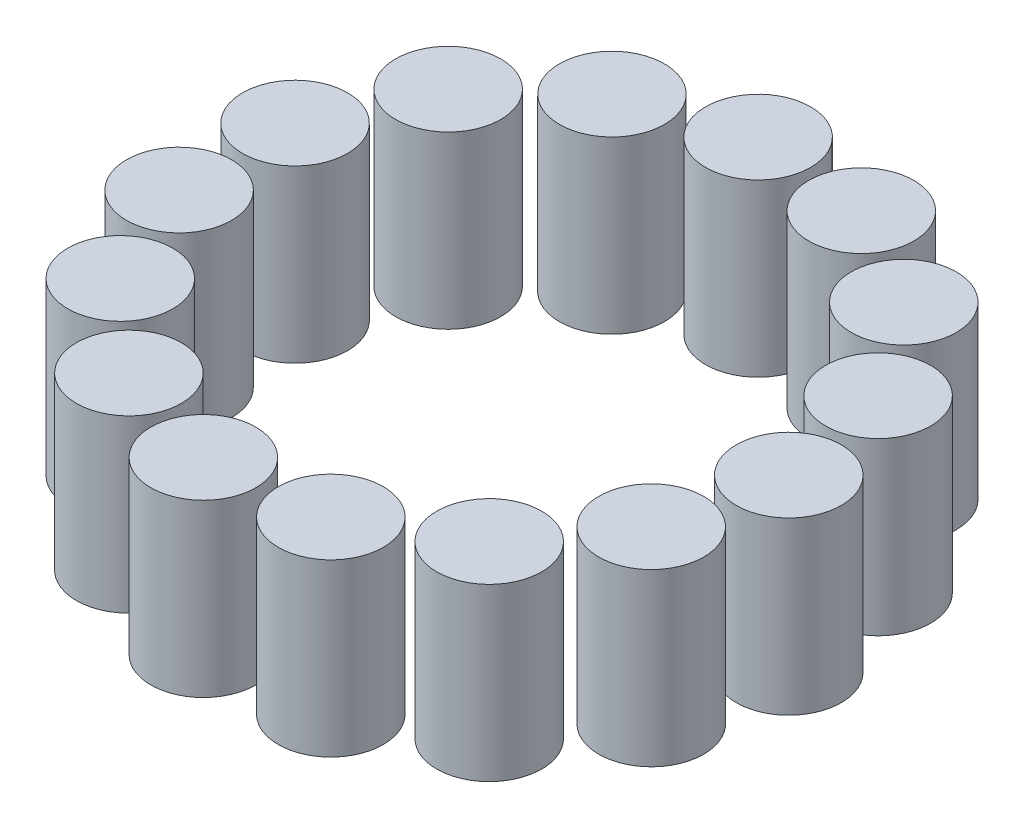
ISO-10303-21;
HEADER;
FILE_DESCRIPTION(('STEP AP214'),'2;1');
FILE_NAME('part.step','',(''),(''),'','','');
FILE_SCHEMA(('AUTOMOTIVE_DESIGN { 1 0 10303 214 1 1 1 1 }'));
ENDSEC;
DATA;
#1=APPLICATION_CONTEXT('core data for automotive mechanical design processes');
#2=APPLICATION_PROTOCOL_DEFINITION('international standard','automotive_design',2000,#1);
#3=PRODUCT_CONTEXT('',#1,'mechanical');
#4=PRODUCT('Part','Part','',(#3));
#5=PRODUCT_RELATED_PRODUCT_CATEGORY('part','',(#4));
#6=PRODUCT_DEFINITION_FORMATION('','',#4);
#7=PRODUCT_DEFINITION_CONTEXT('part definition',#1,'design');
#8=PRODUCT_DEFINITION('design','',#6,#7);
#9=PRODUCT_DEFINITION_SHAPE('','',#8);
#10=(LENGTH_UNIT() NAMED_UNIT(*) SI_UNIT(.MILLI.,.METRE.));
#11=(NAMED_UNIT(*) PLANE_ANGLE_UNIT() SI_UNIT($,.RADIAN.));
#12=(NAMED_UNIT(*) SI_UNIT($,.STERADIAN.) SOLID_ANGLE_UNIT());
#13=UNCERTAINTY_MEASURE_WITH_UNIT(LENGTH_MEASURE(1.E-05),#10,'distance_accuracy_value','');
#14=(GEOMETRIC_REPRESENTATION_CONTEXT(3) GLOBAL_UNCERTAINTY_ASSIGNED_CONTEXT((#13)) GLOBAL_UNIT_ASSIGNED_CONTEXT((#10,
#11,#12)) REPRESENTATION_CONTEXT('',''));
#15=CARTESIAN_POINT('',(0.,0.,0.));
#16=DIRECTION('',(0.,0.,1.));
#17=DIRECTION('',(1.,0.,0.));
#18=AXIS2_PLACEMENT_3D('',#15,#16,#17);
#19=CARTESIAN_POINT('',(14.9136295960155,10.,-6.63997569821225));
#20=DIRECTION('',(0.,-1.,0.));
#21=DIRECTION('',(-0.406736643075789,0.,-0.913545457642606));
#22=AXIS2_PLACEMENT_3D('',#19,#20,#21);
#23=CYLINDRICAL_SURFACE('',#22,3.075);
#24=CARTESIAN_POINT('',(14.9136295960155,10.,-6.63997569821225));
#25=DIRECTION('',(0.,1.,0.));
#26=DIRECTION('',(0.406736643075789,0.,0.913545457642606));
#27=AXIS2_PLACEMENT_3D('',#24,#25,#26);
#28=CIRCLE('',#27,3.075);
#29=CARTESIAN_POINT('',(16.1643447734736,10.,-3.83082341596124));
#30=VERTEX_POINT('',#29);
#31=EDGE_CURVE('E11',#30,#30,#28,.T.);
#32=ORIENTED_EDGE('',*,*,#31,.F.);
#33=EDGE_LOOP('',(#32));
#34=FACE_BOUND('',#33,.T.);
#35=CARTESIAN_POINT('',(14.9136295960155,0.,-6.63997569821225));
#36=DIRECTION('',(0.,1.,0.));
#37=DIRECTION('',(0.406736643075789,0.,0.913545457642606));
#38=AXIS2_PLACEMENT_3D('',#35,#36,#37);
#39=CIRCLE('',#38,3.075);
#40=CARTESIAN_POINT('',(16.1643447734736,0.,-3.83082341596124));
#41=VERTEX_POINT('',#40);
#42=EDGE_CURVE('E42',#41,#41,#39,.T.);
#43=ORIENTED_EDGE('',*,*,#42,.T.);
#44=EDGE_LOOP('',(#43));
#45=FACE_BOUND('',#44,.T.);
#46=ADVANCED_FACE('F39',(#34,#45),#23,.T.);
#47=CARTESIAN_POINT('',(14.9136295960155,10.,-6.63997569821225));
#48=DIRECTION('',(0.,1.,0.));
#49=DIRECTION('',(0.406736643075789,0.,0.913545457642606));
#50=AXIS2_PLACEMENT_3D('',#47,#48,#49);
#51=PLANE('',#50);
#52=ORIENTED_EDGE('',*,*,#31,.T.);
#53=EDGE_LOOP('',(#52));
#54=FACE_BOUND('',#53,.T.);
#55=ADVANCED_FACE('F54',(#54),#51,.T.);
#56=CARTESIAN_POINT('',(14.9136295960155,0.,-6.63997569821225));
#57=DIRECTION('',(0.,1.,0.));
#58=DIRECTION('',(0.406736643075789,0.,0.913545457642606));
#59=AXIS2_PLACEMENT_3D('',#56,#57,#58);
#60=PLANE('',#59);
#61=ORIENTED_EDGE('',*,*,#42,.F.);
#62=EDGE_LOOP('',(#61));
#63=FACE_BOUND('',#62,.T.);
#64=ADVANCED_FACE('F52',(#63),#60,.F.);
#65=CLOSED_SHELL('',(#46,#55,#64));
#66=MANIFOLD_SOLID_BREP('B2',#65);
#67=CARTESIAN_POINT('',(10.9235571488085,10.,-12.1318392759183));
#68=DIRECTION('',(0.,-1.,0.));
#69=DIRECTION('',(-0.743144825477386,0.,-0.669130606358867));
#70=AXIS2_PLACEMENT_3D('',#67,#68,#69);
#71=CYLINDRICAL_SURFACE('',#70,3.075);
#72=CARTESIAN_POINT('',(10.9235571488085,10.,-12.1318392759183));
#73=DIRECTION('',(0.,1.,0.));
#74=DIRECTION('',(0.743144825477386,0.,0.669130606358867));
#75=AXIS2_PLACEMENT_3D('',#72,#73,#74);
#76=CIRCLE('',#75,3.075);
#77=CARTESIAN_POINT('',(13.2087274871515,10.,-10.0742626613648));
#78=VERTEX_POINT('',#77);
#79=EDGE_CURVE('E38',#78,#78,#76,.T.);
#80=ORIENTED_EDGE('',*,*,#79,.F.);
#81=EDGE_LOOP('',(#80));
#82=FACE_BOUND('',#81,.T.);
#83=CARTESIAN_POINT('',(10.9235571488085,0.,-12.1318392759183));
#84=DIRECTION('',(0.,1.,0.));
#85=DIRECTION('',(0.743144825477386,0.,0.669130606358867));
#86=AXIS2_PLACEMENT_3D('',#83,#84,#85);
#87=CIRCLE('',#86,3.075);
#88=CARTESIAN_POINT('',(13.2087274871515,0.,-10.0742626613648));
#89=VERTEX_POINT('',#88);
#90=EDGE_CURVE('E90',#89,#89,#87,.T.);
#91=ORIENTED_EDGE('',*,*,#90,.T.);
#92=EDGE_LOOP('',(#91));
#93=FACE_BOUND('',#92,.T.);
#94=ADVANCED_FACE('F87',(#82,#93),#71,.T.);
#95=CARTESIAN_POINT('',(10.9235571488085,10.,-12.1318392759183));
#96=DIRECTION('',(0.,1.,0.));
#97=DIRECTION('',(0.743144825477386,0.,0.669130606358867));
#98=AXIS2_PLACEMENT_3D('',#95,#96,#97);
#99=PLANE('',#98);
#100=ORIENTED_EDGE('',*,*,#79,.T.);
#101=EDGE_LOOP('',(#100));
#102=FACE_BOUND('',#101,.T.);
#103=ADVANCED_FACE('F102',(#102),#99,.T.);
#104=CARTESIAN_POINT('',(10.9235571488085,0.,-12.1318392759183));
#105=DIRECTION('',(0.,1.,0.));
#106=DIRECTION('',(0.743144825477386,0.,0.669130606358867));
#107=AXIS2_PLACEMENT_3D('',#104,#105,#106);
#108=PLANE('',#107);
#109=ORIENTED_EDGE('',*,*,#90,.F.);
#110=EDGE_LOOP('',(#109));
#111=FACE_BOUND('',#110,.T.);
#112=ADVANCED_FACE('F100',(#111),#108,.F.);
#113=CLOSED_SHELL('',(#94,#103,#112));
#114=MANIFOLD_SOLID_BREP('B6',#113);
#115=CARTESIAN_POINT('',(5.04470243317118,10.,-15.5259976285183));
#116=DIRECTION('',(0.,-1.,0.));
#117=DIRECTION('',(-0.95105651629515,0.,-0.309016994374957));
#118=AXIS2_PLACEMENT_3D('',#115,#116,#117);
#119=CYLINDRICAL_SURFACE('',#118,3.075);
#120=CARTESIAN_POINT('',(5.04470243317118,10.,-15.5259976285183));
#121=DIRECTION('',(0.,1.,0.));
#122=DIRECTION('',(0.95105651629515,0.,0.309016994374957));
#123=AXIS2_PLACEMENT_3D('',#120,#121,#122);
#124=CIRCLE('',#123,3.075);
#125=CARTESIAN_POINT('',(7.96920122077876,10.,-14.5757703708153));
#126=VERTEX_POINT('',#125);
#127=EDGE_CURVE('E86',#126,#126,#124,.T.);
#128=ORIENTED_EDGE('',*,*,#127,.F.);
#129=EDGE_LOOP('',(#128));
#130=FACE_BOUND('',#129,.T.);
#131=CARTESIAN_POINT('',(5.04470243317118,0.,-15.5259976285183));
#132=DIRECTION('',(0.,1.,0.));
#133=DIRECTION('',(0.95105651629515,0.,0.309016994374957));
#134=AXIS2_PLACEMENT_3D('',#131,#132,#133);
#135=CIRCLE('',#134,3.075);
#136=CARTESIAN_POINT('',(7.96920122077876,0.,-14.5757703708153));
#137=VERTEX_POINT('',#136);
#138=EDGE_CURVE('E138',#137,#137,#135,.T.);
#139=ORIENTED_EDGE('',*,*,#138,.T.);
#140=EDGE_LOOP('',(#139));
#141=FACE_BOUND('',#140,.T.);
#142=ADVANCED_FACE('F135',(#130,#141),#119,.T.);
#143=CARTESIAN_POINT('',(5.04470243317118,10.,-15.5259976285183));
#144=DIRECTION('',(0.,1.,0.));
#145=DIRECTION('',(0.95105651629515,0.,0.309016994374957));
#146=AXIS2_PLACEMENT_3D('',#143,#144,#145);
#147=PLANE('',#146);
#148=ORIENTED_EDGE('',*,*,#127,.T.);
#149=EDGE_LOOP('',(#148));
#150=FACE_BOUND('',#149,.T.);
#151=ADVANCED_FACE('F150',(#150),#147,.T.);
#152=CARTESIAN_POINT('',(5.04470243317118,0.,-15.5259976285183));
#153=DIRECTION('',(0.,1.,0.));
#154=DIRECTION('',(0.95105651629515,0.,0.309016994374957));
#155=AXIS2_PLACEMENT_3D('',#152,#153,#154);
#156=PLANE('',#155);
#157=ORIENTED_EDGE('',*,*,#138,.F.);
#158=EDGE_LOOP('',(#157));
#159=FACE_BOUND('',#158,.T.);
#160=ADVANCED_FACE('F148',(#159),#156,.F.);
#161=CLOSED_SHELL('',(#142,#151,#160));
#162=MANIFOLD_SOLID_BREP('B33',#161);
#163=CARTESIAN_POINT('',(-1.70642716284428,10.,-16.2355699418871));
#164=DIRECTION('',(0.,-1.,0.));
#165=DIRECTION('',(-0.994521895368274,0.,0.104528463267644));
#166=AXIS2_PLACEMENT_3D('',#163,#164,#165);
#167=CYLINDRICAL_SURFACE('',#166,3.075);
#168=CARTESIAN_POINT('',(-1.70642716284428,10.,-16.2355699418871));
#169=DIRECTION('',(0.,1.,0.));
#170=DIRECTION('',(0.994521895368274,0.,-0.104528463267644));
#171=AXIS2_PLACEMENT_3D('',#168,#169,#170);
#172=CIRCLE('',#171,3.075);
#173=CARTESIAN_POINT('',(1.35172766541316,10.,-16.5569949664351));
#174=VERTEX_POINT('',#173);
#175=EDGE_CURVE('E134',#174,#174,#172,.T.);
#176=ORIENTED_EDGE('',*,*,#175,.F.);
#177=EDGE_LOOP('',(#176));
#178=FACE_BOUND('',#177,.T.);
#179=CARTESIAN_POINT('',(-1.70642716284428,0.,-16.2355699418871));
#180=DIRECTION('',(0.,1.,0.));
#181=DIRECTION('',(0.994521895368274,0.,-0.104528463267644));
#182=AXIS2_PLACEMENT_3D('',#179,#180,#181);
#183=CIRCLE('',#182,3.075);
#184=CARTESIAN_POINT('',(1.35172766541316,0.,-16.5569949664351));
#185=VERTEX_POINT('',#184);
#186=EDGE_CURVE('E186',#185,#185,#183,.T.);
#187=ORIENTED_EDGE('',*,*,#186,.T.);
#188=EDGE_LOOP('',(#187));
#189=FACE_BOUND('',#188,.T.);
#190=ADVANCED_FACE('F183',(#178,#189),#167,.T.);
#191=CARTESIAN_POINT('',(-1.70642716284428,10.,-16.2355699418871));
#192=DIRECTION('',(0.,1.,0.));
#193=DIRECTION('',(0.994521895368274,0.,-0.104528463267644));
#194=AXIS2_PLACEMENT_3D('',#191,#192,#193);
#195=PLANE('',#194);
#196=ORIENTED_EDGE('',*,*,#175,.T.);
#197=EDGE_LOOP('',(#196));
#198=FACE_BOUND('',#197,.T.);
#199=ADVANCED_FACE('F198',(#198),#195,.T.);
#200=CARTESIAN_POINT('',(-1.70642716284428,0.,-16.2355699418871));
#201=DIRECTION('',(0.,1.,0.));
#202=DIRECTION('',(0.994521895368274,0.,-0.104528463267644));
#203=AXIS2_PLACEMENT_3D('',#200,#201,#202);
#204=PLANE('',#203);
#205=ORIENTED_EDGE('',*,*,#186,.F.);
#206=EDGE_LOOP('',(#205));
#207=FACE_BOUND('',#206,.T.);
#208=ADVANCED_FACE('F196',(#207),#204,.F.);
#209=CLOSED_SHELL('',(#190,#199,#208));
#210=MANIFOLD_SOLID_BREP('B81',#209);
#211=CARTESIAN_POINT('',(-8.16249999999987,10.,-14.137864716781));
#212=DIRECTION('',(0.,-1.,0.));
#213=DIRECTION('',(-0.866025403784443,0.,0.499999999999992));
#214=AXIS2_PLACEMENT_3D('',#211,#212,#213);
#215=CYLINDRICAL_SURFACE('',#214,3.075);
#216=CARTESIAN_POINT('',(-8.16249999999987,10.,-14.137864716781));
#217=DIRECTION('',(0.,1.,0.));
#218=DIRECTION('',(0.866025403784443,0.,-0.499999999999992));
#219=AXIS2_PLACEMENT_3D('',#216,#217,#218);
#220=CIRCLE('',#219,3.075);
#221=CARTESIAN_POINT('',(-5.49947188336271,10.,-15.675364716781));
#222=VERTEX_POINT('',#221);
#223=EDGE_CURVE('E182',#222,#222,#220,.T.);
#224=ORIENTED_EDGE('',*,*,#223,.F.);
#225=EDGE_LOOP('',(#224));
#226=FACE_BOUND('',#225,.T.);
#227=CARTESIAN_POINT('',(-8.16249999999987,0.,-14.137864716781));
#228=DIRECTION('',(0.,1.,0.));
#229=DIRECTION('',(0.866025403784443,0.,-0.499999999999992));
#230=AXIS2_PLACEMENT_3D('',#227,#228,#229);
#231=CIRCLE('',#230,3.075);
#232=CARTESIAN_POINT('',(-5.49947188336271,0.,-15.675364716781));
#233=VERTEX_POINT('',#232);
#234=EDGE_CURVE('E234',#233,#233,#231,.T.);
#235=ORIENTED_EDGE('',*,*,#234,.T.);
#236=EDGE_LOOP('',(#235));
#237=FACE_BOUND('',#236,.T.);
#238=ADVANCED_FACE('F231',(#226,#237),#215,.T.);
#239=CARTESIAN_POINT('',(-8.16249999999987,10.,-14.137864716781));
#240=DIRECTION('',(0.,1.,0.));
#241=DIRECTION('',(0.866025403784443,0.,-0.499999999999992));
#242=AXIS2_PLACEMENT_3D('',#239,#240,#241);
#243=PLANE('',#242);
#244=ORIENTED_EDGE('',*,*,#223,.T.);
#245=EDGE_LOOP('',(#244));
#246=FACE_BOUND('',#245,.T.);
#247=ADVANCED_FACE('F246',(#246),#243,.T.);
#248=CARTESIAN_POINT('',(-8.16249999999987,0.,-14.137864716781));
#249=DIRECTION('',(0.,1.,0.));
#250=DIRECTION('',(0.866025403784443,0.,-0.499999999999992));
#251=AXIS2_PLACEMENT_3D('',#248,#249,#250);
#252=PLANE('',#251);
#253=ORIENTED_EDGE('',*,*,#234,.F.);
#254=EDGE_LOOP('',(#253));
#255=FACE_BOUND('',#254,.T.);
#256=ADVANCED_FACE('F244',(#255),#252,.F.);
#257=CLOSED_SHELL('',(#238,#247,#256));
#258=MANIFOLD_SOLID_BREP('B129',#257);
#259=CARTESIAN_POINT('',(-13.2072024331709,10.,-9.59559424367473));
#260=DIRECTION('',(0.,-1.,0.));
#261=DIRECTION('',(-0.58778525229248,0.,0.809016994374943));
#262=AXIS2_PLACEMENT_3D('',#259,#260,#261);
#263=CYLINDRICAL_SURFACE('',#262,3.075);
#264=CARTESIAN_POINT('',(-13.2072024331709,10.,-9.59559424367473));
#265=DIRECTION('',(0.,1.,0.));
#266=DIRECTION('',(0.58778525229248,0.,-0.809016994374943));
#267=AXIS2_PLACEMENT_3D('',#264,#265,#266);
#268=CIRCLE('',#267,3.075);
#269=CARTESIAN_POINT('',(-11.3997627823716,10.,-12.0833215013777));
#270=VERTEX_POINT('',#269);
#271=EDGE_CURVE('E230',#270,#270,#268,.T.);
#272=ORIENTED_EDGE('',*,*,#271,.F.);
#273=EDGE_LOOP('',(#272));
#274=FACE_BOUND('',#273,.T.);
#275=CARTESIAN_POINT('',(-13.2072024331709,0.,-9.59559424367473));
#276=DIRECTION('',(0.,1.,0.));
#277=DIRECTION('',(0.58778525229248,0.,-0.809016994374943));
#278=AXIS2_PLACEMENT_3D('',#275,#276,#277);
#279=CIRCLE('',#278,3.075);
#280=CARTESIAN_POINT('',(-11.3997627823716,0.,-12.0833215013777));
#281=VERTEX_POINT('',#280);
#282=EDGE_CURVE('E282',#281,#281,#279,.T.);
#283=ORIENTED_EDGE('',*,*,#282,.T.);
#284=EDGE_LOOP('',(#283));
#285=FACE_BOUND('',#284,.T.);
#286=ADVANCED_FACE('F279',(#274,#285),#263,.T.);
#287=CARTESIAN_POINT('',(-13.2072024331709,10.,-9.59559424367473));
#288=DIRECTION('',(0.,1.,0.));
#289=DIRECTION('',(0.58778525229248,0.,-0.809016994374943));
#290=AXIS2_PLACEMENT_3D('',#287,#288,#289);
#291=PLANE('',#290);
#292=ORIENTED_EDGE('',*,*,#271,.T.);
#293=EDGE_LOOP('',(#292));
#294=FACE_BOUND('',#293,.T.);
#295=ADVANCED_FACE('F294',(#294),#291,.T.);
#296=CARTESIAN_POINT('',(-13.2072024331709,0.,-9.59559424367473));
#297=DIRECTION('',(0.,1.,0.));
#298=DIRECTION('',(0.58778525229248,0.,-0.809016994374943));
#299=AXIS2_PLACEMENT_3D('',#296,#297,#298);
#300=PLANE('',#299);
#301=ORIENTED_EDGE('',*,*,#282,.F.);
#302=EDGE_LOOP('',(#301));
#303=FACE_BOUND('',#302,.T.);
#304=ADVANCED_FACE('F292',(#303),#300,.F.);
#305=CLOSED_SHELL('',(#286,#295,#304));
#306=MANIFOLD_SOLID_BREP('B177',#305);
#307=CARTESIAN_POINT('',(-15.9682595819794,10.,-3.39415835260004));
#308=DIRECTION('',(0.,-1.,0.));
#309=DIRECTION('',(-0.207911690817766,0.,0.978147600733804));
#310=AXIS2_PLACEMENT_3D('',#307,#308,#309);
#311=CYLINDRICAL_SURFACE('',#310,3.075);
#312=CARTESIAN_POINT('',(-15.9682595819794,10.,-3.39415835260004));
#313=DIRECTION('',(0.,1.,0.));
#314=DIRECTION('',(0.207911690817766,0.,-0.978147600733804));
#315=AXIS2_PLACEMENT_3D('',#312,#313,#314);
#316=CIRCLE('',#315,3.075);
#317=CARTESIAN_POINT('',(-15.3289311327147,10.,-6.40196222485648));
#318=VERTEX_POINT('',#317);
#319=EDGE_CURVE('E278',#318,#318,#316,.T.);
#320=ORIENTED_EDGE('',*,*,#319,.F.);
#321=EDGE_LOOP('',(#320));
#322=FACE_BOUND('',#321,.T.);
#323=CARTESIAN_POINT('',(-15.9682595819794,0.,-3.39415835260004));
#324=DIRECTION('',(0.,1.,0.));
#325=DIRECTION('',(0.207911690817766,0.,-0.978147600733804));
#326=AXIS2_PLACEMENT_3D('',#323,#324,#325);
#327=CIRCLE('',#326,3.075);
#328=CARTESIAN_POINT('',(-15.3289311327147,0.,-6.40196222485648));
#329=VERTEX_POINT('',#328);
#330=EDGE_CURVE('E330',#329,#329,#327,.T.);
#331=ORIENTED_EDGE('',*,*,#330,.T.);
#332=EDGE_LOOP('',(#331));
#333=FACE_BOUND('',#332,.T.);
#334=ADVANCED_FACE('F327',(#322,#333),#311,.T.);
#335=CARTESIAN_POINT('',(-15.9682595819794,10.,-3.39415835260004));
#336=DIRECTION('',(0.,1.,0.));
#337=DIRECTION('',(0.207911690817766,0.,-0.978147600733804));
#338=AXIS2_PLACEMENT_3D('',#335,#336,#337);
#339=PLANE('',#338);
#340=ORIENTED_EDGE('',*,*,#319,.T.);
#341=EDGE_LOOP('',(#340));
#342=FACE_BOUND('',#341,.T.);
#343=ADVANCED_FACE('F342',(#342),#339,.T.);
#344=CARTESIAN_POINT('',(-15.9682595819794,0.,-3.39415835260004));
#345=DIRECTION('',(0.,1.,0.));
#346=DIRECTION('',(0.207911690817766,0.,-0.978147600733804));
#347=AXIS2_PLACEMENT_3D('',#344,#345,#346);
#348=PLANE('',#347);
#349=ORIENTED_EDGE('',*,*,#330,.F.);
#350=EDGE_LOOP('',(#349));
#351=FACE_BOUND('',#350,.T.);
#352=ADVANCED_FACE('F340',(#351),#348,.F.);
#353=CLOSED_SHELL('',(#334,#343,#352));
#354=MANIFOLD_SOLID_BREP('B225',#353);
#355=CARTESIAN_POINT('',(-15.9682595819794,10.,3.39415835259982));
#356=DIRECTION('',(0.,-1.,0.));
#357=DIRECTION('',(0.207911690817753,0.,0.978147600733807));
#358=AXIS2_PLACEMENT_3D('',#355,#356,#357);
#359=CYLINDRICAL_SURFACE('',#358,3.075);
#360=CARTESIAN_POINT('',(-15.9682595819794,10.,3.39415835259982));
#361=DIRECTION('',(0.,1.,0.));
#362=DIRECTION('',(-0.207911690817753,0.,-0.978147600733807));
#363=AXIS2_PLACEMENT_3D('',#360,#361,#362);
#364=CIRCLE('',#363,3.075);
#365=CARTESIAN_POINT('',(-16.607588031244,10.,0.386354480343369));
#366=VERTEX_POINT('',#365);
#367=EDGE_CURVE('E326',#366,#366,#364,.T.);
#368=ORIENTED_EDGE('',*,*,#367,.F.);
#369=EDGE_LOOP('',(#368));
#370=FACE_BOUND('',#369,.T.);
#371=CARTESIAN_POINT('',(-15.9682595819794,0.,3.39415835259982));
#372=DIRECTION('',(0.,1.,0.));
#373=DIRECTION('',(-0.207911690817753,0.,-0.978147600733807));
#374=AXIS2_PLACEMENT_3D('',#371,#372,#373);
#375=CIRCLE('',#374,3.075);
#376=CARTESIAN_POINT('',(-16.607588031244,0.,0.386354480343369));
#377=VERTEX_POINT('',#376);
#378=EDGE_CURVE('E378',#377,#377,#375,.T.);
#379=ORIENTED_EDGE('',*,*,#378,.T.);
#380=EDGE_LOOP('',(#379));
#381=FACE_BOUND('',#380,.T.);
#382=ADVANCED_FACE('F375',(#370,#381),#359,.T.);
#383=CARTESIAN_POINT('',(-15.9682595819794,10.,3.39415835259982));
#384=DIRECTION('',(0.,1.,0.));
#385=DIRECTION('',(-0.207911690817753,0.,-0.978147600733807));
#386=AXIS2_PLACEMENT_3D('',#383,#384,#385);
#387=PLANE('',#386);
#388=ORIENTED_EDGE('',*,*,#367,.T.);
#389=EDGE_LOOP('',(#388));
#390=FACE_BOUND('',#389,.T.);
#391=ADVANCED_FACE('F390',(#390),#387,.T.);
#392=CARTESIAN_POINT('',(-15.9682595819794,0.,3.39415835259982));
#393=DIRECTION('',(0.,1.,0.));
#394=DIRECTION('',(-0.207911690817753,0.,-0.978147600733807));
#395=AXIS2_PLACEMENT_3D('',#392,#393,#394);
#396=PLANE('',#395);
#397=ORIENTED_EDGE('',*,*,#378,.F.);
#398=EDGE_LOOP('',(#397));
#399=FACE_BOUND('',#398,.T.);
#400=ADVANCED_FACE('F388',(#399),#396,.F.);
#401=CLOSED_SHELL('',(#382,#391,#400));
#402=MANIFOLD_SOLID_BREP('B273',#401);
#403=CARTESIAN_POINT('',(-13.2072024331711,10.,9.59559424367455));
#404=DIRECTION('',(0.,-1.,0.));
#405=DIRECTION('',(0.587785252292469,0.,0.80901699437495));
#406=AXIS2_PLACEMENT_3D('',#403,#404,#405);
#407=CYLINDRICAL_SURFACE('',#406,3.075);
#408=CARTESIAN_POINT('',(-13.2072024331711,10.,9.59559424367455));
#409=DIRECTION('',(0.,1.,0.));
#410=DIRECTION('',(-0.587785252292469,0.,-0.80901699437495));
#411=AXIS2_PLACEMENT_3D('',#408,#409,#410);
#412=CIRCLE('',#411,3.075);
#413=CARTESIAN_POINT('',(-15.0146420839704,10.,7.10786698597158));
#414=VERTEX_POINT('',#413);
#415=EDGE_CURVE('E374',#414,#414,#412,.T.);
#416=ORIENTED_EDGE('',*,*,#415,.F.);
#417=EDGE_LOOP('',(#416));
#418=FACE_BOUND('',#417,.T.);
#419=CARTESIAN_POINT('',(-13.2072024331711,0.,9.59559424367455));
#420=DIRECTION('',(0.,1.,0.));
#421=DIRECTION('',(-0.587785252292469,0.,-0.80901699437495));
#422=AXIS2_PLACEMENT_3D('',#419,#420,#421);
#423=CIRCLE('',#422,3.075);
#424=CARTESIAN_POINT('',(-15.0146420839704,0.,7.10786698597158));
#425=VERTEX_POINT('',#424);
#426=EDGE_CURVE('E426',#425,#425,#423,.T.);
#427=ORIENTED_EDGE('',*,*,#426,.T.);
#428=EDGE_LOOP('',(#427));
#429=FACE_BOUND('',#428,.T.);
#430=ADVANCED_FACE('F423',(#418,#429),#407,.T.);
#431=CARTESIAN_POINT('',(-13.2072024331711,10.,9.59559424367455));
#432=DIRECTION('',(0.,1.,0.));
#433=DIRECTION('',(-0.587785252292469,0.,-0.80901699437495));
#434=AXIS2_PLACEMENT_3D('',#431,#432,#433);
#435=PLANE('',#434);
#436=ORIENTED_EDGE('',*,*,#415,.T.);
#437=EDGE_LOOP('',(#436));
#438=FACE_BOUND('',#437,.T.);
#439=ADVANCED_FACE('F438',(#438),#435,.T.);
#440=CARTESIAN_POINT('',(-13.2072024331711,0.,9.59559424367455));
#441=DIRECTION('',(0.,1.,0.));
#442=DIRECTION('',(-0.587785252292469,0.,-0.80901699437495));
#443=AXIS2_PLACEMENT_3D('',#440,#441,#442);
#444=PLANE('',#443);
#445=ORIENTED_EDGE('',*,*,#426,.F.);
#446=EDGE_LOOP('',(#445));
#447=FACE_BOUND('',#446,.T.);
#448=ADVANCED_FACE('F436',(#447),#444,.F.);
#449=CLOSED_SHELL('',(#430,#439,#448));
#450=MANIFOLD_SOLID_BREP('B321',#449);
#451=CARTESIAN_POINT('',(-8.16250000000007,10.,14.1378647167809));
#452=DIRECTION('',(0.,-1.,0.));
#453=DIRECTION('',(0.866025403784436,0.,0.500000000000004));
#454=AXIS2_PLACEMENT_3D('',#451,#452,#453);
#455=CYLINDRICAL_SURFACE('',#454,3.075);
#456=CARTESIAN_POINT('',(-8.16250000000007,10.,14.1378647167809));
#457=DIRECTION('',(0.,1.,0.));
#458=DIRECTION('',(-0.866025403784436,0.,-0.500000000000004));
#459=AXIS2_PLACEMENT_3D('',#456,#457,#458);
#460=CIRCLE('',#459,3.075);
#461=CARTESIAN_POINT('',(-10.8255281166372,10.,12.6003647167809));
#462=VERTEX_POINT('',#461);
#463=EDGE_CURVE('E422',#462,#462,#460,.T.);
#464=ORIENTED_EDGE('',*,*,#463,.F.);
#465=EDGE_LOOP('',(#464));
#466=FACE_BOUND('',#465,.T.);
#467=CARTESIAN_POINT('',(-8.16250000000007,0.,14.1378647167809));
#468=DIRECTION('',(0.,1.,0.));
#469=DIRECTION('',(-0.866025403784436,0.,-0.500000000000004));
#470=AXIS2_PLACEMENT_3D('',#467,#468,#469);
#471=CIRCLE('',#470,3.075);
#472=CARTESIAN_POINT('',(-10.8255281166372,0.,12.6003647167809));
#473=VERTEX_POINT('',#472);
#474=EDGE_CURVE('E474',#473,#473,#471,.T.);
#475=ORIENTED_EDGE('',*,*,#474,.T.);
#476=EDGE_LOOP('',(#475));
#477=FACE_BOUND('',#476,.T.);
#478=ADVANCED_FACE('F471',(#466,#477),#455,.T.);
#479=CARTESIAN_POINT('',(-8.16250000000007,10.,14.1378647167809));
#480=DIRECTION('',(0.,1.,0.));
#481=DIRECTION('',(-0.866025403784436,0.,-0.500000000000004));
#482=AXIS2_PLACEMENT_3D('',#479,#480,#481);
#483=PLANE('',#482);
#484=ORIENTED_EDGE('',*,*,#463,.T.);
#485=EDGE_LOOP('',(#484));
#486=FACE_BOUND('',#485,.T.);
#487=ADVANCED_FACE('F486',(#486),#483,.T.);
#488=CARTESIAN_POINT('',(-8.16250000000007,0.,14.1378647167809));
#489=DIRECTION('',(0.,1.,0.));
#490=DIRECTION('',(-0.866025403784436,0.,-0.500000000000004));
#491=AXIS2_PLACEMENT_3D('',#488,#489,#490);
#492=PLANE('',#491);
#493=ORIENTED_EDGE('',*,*,#474,.F.);
#494=EDGE_LOOP('',(#493));
#495=FACE_BOUND('',#494,.T.);
#496=ADVANCED_FACE('F484',(#495),#492,.F.);
#497=CLOSED_SHELL('',(#478,#487,#496));
#498=MANIFOLD_SOLID_BREP('B369',#497);
#499=CARTESIAN_POINT('',(-1.7064271628445,10.,16.2355699418871));
#500=DIRECTION('',(0.,-1.,0.));
#501=DIRECTION('',(0.994521895368273,0.,0.104528463267657));
#502=AXIS2_PLACEMENT_3D('',#499,#500,#501);
#503=CYLINDRICAL_SURFACE('',#502,3.075);
#504=CARTESIAN_POINT('',(-1.7064271628445,10.,16.2355699418871));
#505=DIRECTION('',(0.,1.,0.));
#506=DIRECTION('',(-0.994521895368273,0.,-0.104528463267657));
#507=AXIS2_PLACEMENT_3D('',#504,#505,#506);
#508=CIRCLE('',#507,3.075);
#509=CARTESIAN_POINT('',(-4.76458199110194,10.,15.914144917339));
#510=VERTEX_POINT('',#509);
#511=EDGE_CURVE('E470',#510,#510,#508,.T.);
#512=ORIENTED_EDGE('',*,*,#511,.F.);
#513=EDGE_LOOP('',(#512));
#514=FACE_BOUND('',#513,.T.);
#515=CARTESIAN_POINT('',(-1.7064271628445,0.,16.2355699418871));
#516=DIRECTION('',(0.,1.,0.));
#517=DIRECTION('',(-0.994521895368273,0.,-0.104528463267657));
#518=AXIS2_PLACEMENT_3D('',#515,#516,#517);
#519=CIRCLE('',#518,3.075);
#520=CARTESIAN_POINT('',(-4.76458199110194,0.,15.914144917339));
#521=VERTEX_POINT('',#520);
#522=EDGE_CURVE('E522',#521,#521,#519,.T.);
#523=ORIENTED_EDGE('',*,*,#522,.T.);
#524=EDGE_LOOP('',(#523));
#525=FACE_BOUND('',#524,.T.);
#526=ADVANCED_FACE('F519',(#514,#525),#503,.T.);
#527=CARTESIAN_POINT('',(-1.7064271628445,10.,16.2355699418871));
#528=DIRECTION('',(0.,1.,0.));
#529=DIRECTION('',(-0.994521895368273,0.,-0.104528463267657));
#530=AXIS2_PLACEMENT_3D('',#527,#528,#529);
#531=PLANE('',#530);
#532=ORIENTED_EDGE('',*,*,#511,.T.);
#533=EDGE_LOOP('',(#532));
#534=FACE_BOUND('',#533,.T.);
#535=ADVANCED_FACE('F534',(#534),#531,.T.);
#536=CARTESIAN_POINT('',(-1.7064271628445,0.,16.2355699418871));
#537=DIRECTION('',(0.,1.,0.));
#538=DIRECTION('',(-0.994521895368273,0.,-0.104528463267657));
#539=AXIS2_PLACEMENT_3D('',#536,#537,#538);
#540=PLANE('',#539);
#541=ORIENTED_EDGE('',*,*,#522,.F.);
#542=EDGE_LOOP('',(#541));
#543=FACE_BOUND('',#542,.T.);
#544=ADVANCED_FACE('F532',(#543),#540,.F.);
#545=CLOSED_SHELL('',(#526,#535,#544));
#546=MANIFOLD_SOLID_BREP('B417',#545);
#547=CARTESIAN_POINT('',(5.04470243317098,10.,15.5259976285184));
#548=DIRECTION('',(0.,-1.,0.));
#549=DIRECTION('',(0.951056516295154,0.,-0.309016994374945));
#550=AXIS2_PLACEMENT_3D('',#547,#548,#549);
#551=CYLINDRICAL_SURFACE('',#550,3.075);
#552=CARTESIAN_POINT('',(5.04470243317098,10.,15.5259976285184));
#553=DIRECTION('',(0.,1.,0.));
#554=DIRECTION('',(-0.951056516295154,0.,0.309016994374945));
#555=AXIS2_PLACEMENT_3D('',#552,#553,#554);
#556=CIRCLE('',#555,3.075);
#557=CARTESIAN_POINT('',(2.12020364556338,10.,16.4762248862214));
#558=VERTEX_POINT('',#557);
#559=EDGE_CURVE('E518',#558,#558,#556,.T.);
#560=ORIENTED_EDGE('',*,*,#559,.F.);
#561=EDGE_LOOP('',(#560));
#562=FACE_BOUND('',#561,.T.);
#563=CARTESIAN_POINT('',(5.04470243317098,0.,15.5259976285184));
#564=DIRECTION('',(0.,1.,0.));
#565=DIRECTION('',(-0.951056516295154,0.,0.309016994374945));
#566=AXIS2_PLACEMENT_3D('',#563,#564,#565);
#567=CIRCLE('',#566,3.075);
#568=CARTESIAN_POINT('',(2.12020364556338,0.,16.4762248862214));
#569=VERTEX_POINT('',#568);
#570=EDGE_CURVE('E570',#569,#569,#567,.T.);
#571=ORIENTED_EDGE('',*,*,#570,.T.);
#572=EDGE_LOOP('',(#571));
#573=FACE_BOUND('',#572,.T.);
#574=ADVANCED_FACE('F567',(#562,#573),#551,.T.);
#575=CARTESIAN_POINT('',(5.04470243317098,10.,15.5259976285184));
#576=DIRECTION('',(0.,1.,0.));
#577=DIRECTION('',(-0.951056516295154,0.,0.309016994374945));
#578=AXIS2_PLACEMENT_3D('',#575,#576,#577);
#579=PLANE('',#578);
#580=ORIENTED_EDGE('',*,*,#559,.T.);
#581=EDGE_LOOP('',(#580));
#582=FACE_BOUND('',#581,.T.);
#583=ADVANCED_FACE('F582',(#582),#579,.T.);
#584=CARTESIAN_POINT('',(5.04470243317098,0.,15.5259976285184));
#585=DIRECTION('',(0.,1.,0.));
#586=DIRECTION('',(-0.951056516295154,0.,0.309016994374945));
#587=AXIS2_PLACEMENT_3D('',#584,#585,#586);
#588=PLANE('',#587);
#589=ORIENTED_EDGE('',*,*,#570,.F.);
#590=EDGE_LOOP('',(#589));
#591=FACE_BOUND('',#590,.T.);
#592=ADVANCED_FACE('F580',(#591),#588,.F.);
#593=CLOSED_SHELL('',(#574,#583,#592));
#594=MANIFOLD_SOLID_BREP('B465',#593);
#595=CARTESIAN_POINT('',(10.9235571488083,10.,12.1318392759185));
#596=DIRECTION('',(0.,-1.,0.));
#597=DIRECTION('',(0.743144825477395,0.,-0.669130606358857));
#598=AXIS2_PLACEMENT_3D('',#595,#596,#597);
#599=CYLINDRICAL_SURFACE('',#598,3.075);
#600=CARTESIAN_POINT('',(10.9235571488083,10.,12.1318392759185));
#601=DIRECTION('',(0.,1.,0.));
#602=DIRECTION('',(-0.743144825477395,0.,0.669130606358857));
#603=AXIS2_PLACEMENT_3D('',#600,#601,#602);
#604=CIRCLE('',#603,3.075);
#605=CARTESIAN_POINT('',(8.63838681046535,10.,14.189415890472));
#606=VERTEX_POINT('',#605);
#607=EDGE_CURVE('E566',#606,#606,#604,.T.);
#608=ORIENTED_EDGE('',*,*,#607,.F.);
#609=EDGE_LOOP('',(#608));
#610=FACE_BOUND('',#609,.T.);
#611=CARTESIAN_POINT('',(10.9235571488083,0.,12.1318392759185));
#612=DIRECTION('',(0.,1.,0.));
#613=DIRECTION('',(-0.743144825477395,0.,0.669130606358857));
#614=AXIS2_PLACEMENT_3D('',#611,#612,#613);
#615=CIRCLE('',#614,3.075);
#616=CARTESIAN_POINT('',(8.63838681046535,0.,14.189415890472));
#617=VERTEX_POINT('',#616);
#618=EDGE_CURVE('E618',#617,#617,#615,.T.);
#619=ORIENTED_EDGE('',*,*,#618,.T.);
#620=EDGE_LOOP('',(#619));
#621=FACE_BOUND('',#620,.T.);
#622=ADVANCED_FACE('F615',(#610,#621),#599,.T.);
#623=CARTESIAN_POINT('',(10.9235571488083,10.,12.1318392759185));
#624=DIRECTION('',(0.,1.,0.));
#625=DIRECTION('',(-0.743144825477395,0.,0.669130606358857));
#626=AXIS2_PLACEMENT_3D('',#623,#624,#625);
#627=PLANE('',#626);
#628=ORIENTED_EDGE('',*,*,#607,.T.);
#629=EDGE_LOOP('',(#628));
#630=FACE_BOUND('',#629,.T.);
#631=ADVANCED_FACE('F630',(#630),#627,.T.);
#632=CARTESIAN_POINT('',(10.9235571488083,0.,12.1318392759185));
#633=DIRECTION('',(0.,1.,0.));
#634=DIRECTION('',(-0.743144825477395,0.,0.669130606358857));
#635=AXIS2_PLACEMENT_3D('',#632,#633,#634);
#636=PLANE('',#635);
#637=ORIENTED_EDGE('',*,*,#618,.F.);
#638=EDGE_LOOP('',(#637));
#639=FACE_BOUND('',#638,.T.);
#640=ADVANCED_FACE('F628',(#639),#636,.F.);
#641=CLOSED_SHELL('',(#622,#631,#640));
#642=MANIFOLD_SOLID_BREP('B513',#641);
#643=CARTESIAN_POINT('',(14.9136295960155,10.,6.63997569821245));
#644=DIRECTION('',(0.,-1.,0.));
#645=DIRECTION('',(0.406736643075801,0.,-0.913545457642601));
#646=AXIS2_PLACEMENT_3D('',#643,#644,#645);
#647=CYLINDRICAL_SURFACE('',#646,3.075);
#648=CARTESIAN_POINT('',(14.9136295960155,10.,6.63997569821245));
#649=DIRECTION('',(0.,1.,0.));
#650=DIRECTION('',(-0.406736643075801,0.,0.913545457642601));
#651=AXIS2_PLACEMENT_3D('',#648,#649,#650);
#652=CIRCLE('',#651,3.075);
#653=CARTESIAN_POINT('',(13.6629144185574,10.,9.44912798046344));
#654=VERTEX_POINT('',#653);
#655=EDGE_CURVE('E614',#654,#654,#652,.T.);
#656=ORIENTED_EDGE('',*,*,#655,.F.);
#657=EDGE_LOOP('',(#656));
#658=FACE_BOUND('',#657,.T.);
#659=CARTESIAN_POINT('',(14.9136295960155,0.,6.63997569821245));
#660=DIRECTION('',(0.,1.,0.));
#661=DIRECTION('',(-0.406736643075801,0.,0.913545457642601));
#662=AXIS2_PLACEMENT_3D('',#659,#660,#661);
#663=CIRCLE('',#662,3.075);
#664=CARTESIAN_POINT('',(13.6629144185574,0.,9.44912798046344));
#665=VERTEX_POINT('',#664);
#666=EDGE_CURVE('E665',#665,#665,#663,.T.);
#667=ORIENTED_EDGE('',*,*,#666,.T.);
#668=EDGE_LOOP('',(#667));
#669=FACE_BOUND('',#668,.T.);
#670=ADVANCED_FACE('F662',(#658,#669),#647,.T.);
#671=CARTESIAN_POINT('',(14.9136295960155,10.,6.63997569821245));
#672=DIRECTION('',(0.,1.,0.));
#673=DIRECTION('',(-0.406736643075801,0.,0.913545457642601));
#674=AXIS2_PLACEMENT_3D('',#671,#672,#673);
#675=PLANE('',#674);
#676=ORIENTED_EDGE('',*,*,#655,.T.);
#677=EDGE_LOOP('',(#676));
#678=FACE_BOUND('',#677,.T.);
#679=ADVANCED_FACE('F677',(#678),#675,.T.);
#680=CARTESIAN_POINT('',(14.9136295960155,0.,6.63997569821245));
#681=DIRECTION('',(0.,1.,0.));
#682=DIRECTION('',(-0.406736643075801,0.,0.913545457642601));
#683=AXIS2_PLACEMENT_3D('',#680,#681,#682);
#684=PLANE('',#683);
#685=ORIENTED_EDGE('',*,*,#666,.F.);
#686=EDGE_LOOP('',(#685));
#687=FACE_BOUND('',#686,.T.);
#688=ADVANCED_FACE('F675',(#687),#684,.F.);
#689=CLOSED_SHELL('',(#670,#679,#688));
#690=MANIFOLD_SOLID_BREP('B561',#689);
#691=CARTESIAN_POINT('',(16.325,10.,0.));
#692=DIRECTION('',(0.,-1.,0.));
#693=DIRECTION('',(0.,0.,-1.));
#694=AXIS2_PLACEMENT_3D('',#691,#692,#693);
#695=CYLINDRICAL_SURFACE('',#694,3.075);
#696=CARTESIAN_POINT('',(16.325,10.,0.));
#697=DIRECTION('',(0.,1.,0.));
#698=DIRECTION('',(0.,0.,1.));
#699=AXIS2_PLACEMENT_3D('',#696,#697,#698);
#700=CIRCLE('',#699,3.075);
#701=CARTESIAN_POINT('',(16.325,10.,3.075));
#702=VERTEX_POINT('',#701);
#703=EDGE_CURVE('E661',#702,#702,#700,.T.);
#704=ORIENTED_EDGE('',*,*,#703,.F.);
#705=EDGE_LOOP('',(#704));
#706=FACE_BOUND('',#705,.T.);
#707=CARTESIAN_POINT('',(16.325,0.,0.));
#708=DIRECTION('',(0.,1.,0.));
#709=DIRECTION('',(0.,0.,1.));
#710=AXIS2_PLACEMENT_3D('',#707,#708,#709);
#711=CIRCLE('',#710,3.075);
#712=CARTESIAN_POINT('',(16.325,0.,3.075));
#713=VERTEX_POINT('',#712);
#714=EDGE_CURVE('E705',#713,#713,#711,.T.);
#715=ORIENTED_EDGE('',*,*,#714,.T.);
#716=EDGE_LOOP('',(#715));
#717=FACE_BOUND('',#716,.T.);
#718=ADVANCED_FACE('F702',(#706,#717),#695,.T.);
#719=CARTESIAN_POINT('',(16.325,10.,0.));
#720=DIRECTION('',(0.,1.,0.));
#721=DIRECTION('',(0.,0.,1.));
#722=AXIS2_PLACEMENT_3D('',#719,#720,#721);
#723=PLANE('',#722);
#724=ORIENTED_EDGE('',*,*,#703,.T.);
#725=EDGE_LOOP('',(#724));
#726=FACE_BOUND('',#725,.T.);
#727=ADVANCED_FACE('F717',(#726),#723,.T.);
#728=CARTESIAN_POINT('',(16.325,0.,0.));
#729=DIRECTION('',(0.,1.,0.));
#730=DIRECTION('',(0.,0.,1.));
#731=AXIS2_PLACEMENT_3D('',#728,#729,#730);
#732=PLANE('',#731);
#733=ORIENTED_EDGE('',*,*,#714,.F.);
#734=EDGE_LOOP('',(#733));
#735=FACE_BOUND('',#734,.T.);
#736=ADVANCED_FACE('F715',(#735),#732,.F.);
#737=CLOSED_SHELL('',(#718,#727,#736));
#738=MANIFOLD_SOLID_BREP('B609',#737);
#739=ADVANCED_BREP_SHAPE_REPRESENTATION('',(#18,#66,#114,#162,#210,#258,#306,#354,#402,#450,
#498,#546,#594,#642,#690,#738),#14);
#740=SHAPE_DEFINITION_REPRESENTATION(#9,#739);
ENDSEC;
END-ISO-10303-21;
